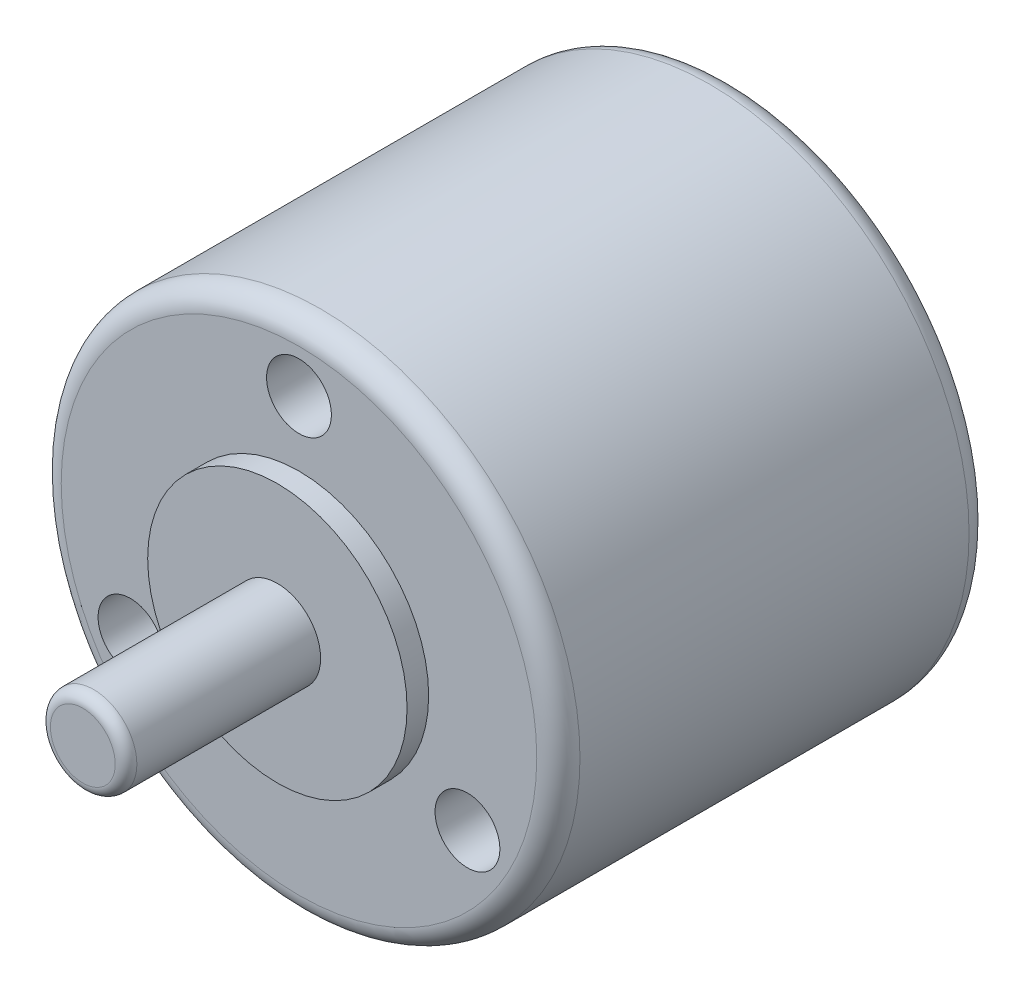
ISO-10303-21;
HEADER;
FILE_DESCRIPTION(('STEP AP214'),'2;1');
FILE_NAME('part.step','',(''),(''),'','','');
FILE_SCHEMA(('AUTOMOTIVE_DESIGN { 1 0 10303 214 1 1 1 1 }'));
ENDSEC;
DATA;
#1=APPLICATION_CONTEXT('core data for automotive mechanical design processes');
#2=APPLICATION_PROTOCOL_DEFINITION('international standard','automotive_design',2000,#1);
#3=PRODUCT_CONTEXT('',#1,'mechanical');
#4=PRODUCT('Part','Part','',(#3));
#5=PRODUCT_RELATED_PRODUCT_CATEGORY('part','',(#4));
#6=PRODUCT_DEFINITION_FORMATION('','',#4);
#7=PRODUCT_DEFINITION_CONTEXT('part definition',#1,'design');
#8=PRODUCT_DEFINITION('design','',#6,#7);
#9=PRODUCT_DEFINITION_SHAPE('','',#8);
#10=(LENGTH_UNIT() NAMED_UNIT(*) SI_UNIT(.MILLI.,.METRE.));
#11=(NAMED_UNIT(*) PLANE_ANGLE_UNIT() SI_UNIT($,.RADIAN.));
#12=(NAMED_UNIT(*) SI_UNIT($,.STERADIAN.) SOLID_ANGLE_UNIT());
#13=UNCERTAINTY_MEASURE_WITH_UNIT(LENGTH_MEASURE(1.E-05),#10,'distance_accuracy_value','');
#14=(GEOMETRIC_REPRESENTATION_CONTEXT(3) GLOBAL_UNCERTAINTY_ASSIGNED_CONTEXT((#13)) GLOBAL_UNIT_ASSIGNED_CONTEXT((#10,
#11,#12)) REPRESENTATION_CONTEXT('',''));
#15=CARTESIAN_POINT('',(0.,0.,0.));
#16=DIRECTION('',(0.,0.,1.));
#17=DIRECTION('',(1.,0.,0.));
#18=AXIS2_PLACEMENT_3D('',#15,#16,#17);
#19=CARTESIAN_POINT('',(0.,0.,0.));
#20=DIRECTION('',(0.,0.,1.));
#21=DIRECTION('',(1.,0.,0.));
#22=AXIS2_PLACEMENT_3D('',#19,#20,#21);
#23=PLANE('',#22);
#24=CARTESIAN_POINT('',(7.79422863405994,-4.50000000000002,0.));
#25=DIRECTION('',(0.,0.,1.));
#26=DIRECTION('',(1.,0.,0.));
#27=AXIS2_PLACEMENT_3D('',#24,#25,#26);
#28=CIRCLE('',#27,1.5);
#29=CARTESIAN_POINT('',(9.29422863405994,-4.50000000000002,0.));
#30=VERTEX_POINT('',#29);
#31=EDGE_CURVE('E77',#30,#30,#28,.T.);
#32=ORIENTED_EDGE('',*,*,#31,.F.);
#33=EDGE_LOOP('',(#32));
#34=FACE_BOUND('',#33,.T.);
#35=CARTESIAN_POINT('',(-7.79422863405994,-4.50000000000001,0.));
#36=DIRECTION('',(0.,0.,1.));
#37=DIRECTION('',(1.,0.,0.));
#38=AXIS2_PLACEMENT_3D('',#35,#36,#37);
#39=CIRCLE('',#38,1.5);
#40=CARTESIAN_POINT('',(-6.29422863405994,-4.50000000000001,0.));
#41=VERTEX_POINT('',#40);
#42=EDGE_CURVE('E71',#41,#41,#39,.T.);
#43=ORIENTED_EDGE('',*,*,#42,.F.);
#44=EDGE_LOOP('',(#43));
#45=FACE_BOUND('',#44,.T.);
#46=CARTESIAN_POINT('',(0.,9.,0.));
#47=DIRECTION('',(0.,0.,1.));
#48=DIRECTION('',(1.,0.,0.));
#49=AXIS2_PLACEMENT_3D('',#46,#47,#48);
#50=CIRCLE('',#49,1.5);
#51=CARTESIAN_POINT('',(1.5,9.,0.));
#52=VERTEX_POINT('',#51);
#53=EDGE_CURVE('E65',#52,#52,#50,.T.);
#54=ORIENTED_EDGE('',*,*,#53,.F.);
#55=EDGE_LOOP('',(#54));
#56=FACE_BOUND('',#55,.T.);
#57=CARTESIAN_POINT('',(0.,0.,0.));
#58=DIRECTION('',(0.,0.,1.));
#59=DIRECTION('',(1.,0.,0.));
#60=AXIS2_PLACEMENT_3D('',#57,#58,#59);
#61=CIRCLE('',#60,11.);
#62=CARTESIAN_POINT('',(11.,0.,0.));
#63=VERTEX_POINT('',#62);
#64=EDGE_CURVE('E55',#63,#63,#61,.T.);
#65=ORIENTED_EDGE('',*,*,#64,.T.);
#66=EDGE_LOOP('',(#65));
#67=FACE_BOUND('',#66,.T.);
#68=CARTESIAN_POINT('',(0.,0.,0.));
#69=DIRECTION('',(0.,0.,1.));
#70=DIRECTION('',(1.,0.,0.));
#71=AXIS2_PLACEMENT_3D('',#68,#69,#70);
#72=CIRCLE('',#71,6.);
#73=CARTESIAN_POINT('',(6.,0.,0.));
#74=VERTEX_POINT('',#73);
#75=EDGE_CURVE('E58',#74,#74,#72,.T.);
#76=ORIENTED_EDGE('',*,*,#75,.F.);
#77=EDGE_LOOP('',(#76));
#78=FACE_BOUND('',#77,.T.);
#79=ADVANCED_FACE('F32',(#34,#45,#56,#67,#78),#23,.T.);
#80=CARTESIAN_POINT('',(0.,0.,-20.));
#81=DIRECTION('',(0.,0.,1.));
#82=DIRECTION('',(1.,0.,0.));
#83=AXIS2_PLACEMENT_3D('',#80,#81,#82);
#84=CYLINDRICAL_SURFACE('',#83,12.);
#85=CARTESIAN_POINT('',(0.,0.,-19.));
#86=DIRECTION('',(0.,0.,1.));
#87=DIRECTION('',(1.,0.,0.));
#88=AXIS2_PLACEMENT_3D('',#85,#86,#87);
#89=CIRCLE('',#88,12.);
#90=CARTESIAN_POINT('',(12.,0.,-19.));
#91=VERTEX_POINT('',#90);
#92=EDGE_CURVE('E49',#91,#91,#89,.T.);
#93=ORIENTED_EDGE('',*,*,#92,.T.);
#94=EDGE_LOOP('',(#93));
#95=FACE_BOUND('',#94,.T.);
#96=CARTESIAN_POINT('',(0.,0.,-1.));
#97=DIRECTION('',(0.,0.,1.));
#98=DIRECTION('',(1.,0.,0.));
#99=AXIS2_PLACEMENT_3D('',#96,#97,#98);
#100=CIRCLE('',#99,12.);
#101=CARTESIAN_POINT('',(12.,0.,-1.));
#102=VERTEX_POINT('',#101);
#103=EDGE_CURVE('E52',#102,#102,#100,.F.);
#104=ORIENTED_EDGE('',*,*,#103,.T.);
#105=EDGE_LOOP('',(#104));
#106=FACE_BOUND('',#105,.T.);
#107=ADVANCED_FACE('F94',(#95,#106),#84,.T.);
#108=CARTESIAN_POINT('',(0.,0.,-20.));
#109=DIRECTION('',(0.,0.,1.));
#110=DIRECTION('',(1.,0.,0.));
#111=AXIS2_PLACEMENT_3D('',#108,#109,#110);
#112=PLANE('',#111);
#113=CARTESIAN_POINT('',(0.,0.,-20.));
#114=DIRECTION('',(0.,0.,1.));
#115=DIRECTION('',(1.,0.,0.));
#116=AXIS2_PLACEMENT_3D('',#113,#114,#115);
#117=CIRCLE('',#116,11.);
#118=CARTESIAN_POINT('',(11.,0.,-20.));
#119=VERTEX_POINT('',#118);
#120=EDGE_CURVE('E44',#119,#119,#117,.F.);
#121=ORIENTED_EDGE('',*,*,#120,.T.);
#122=EDGE_LOOP('',(#121));
#123=FACE_BOUND('',#122,.T.);
#124=ADVANCED_FACE('F127',(#123),#112,.F.);
#125=CARTESIAN_POINT('',(0.,0.,-1.));
#126=DIRECTION('',(0.,0.,1.));
#127=DIRECTION('',(1.,0.,0.));
#128=AXIS2_PLACEMENT_3D('',#125,#126,#127);
#129=TOROIDAL_SURFACE('',#128,11.,1.);
#130=ORIENTED_EDGE('',*,*,#103,.F.);
#131=EDGE_LOOP('',(#130));
#132=FACE_BOUND('',#131,.T.);
#133=ORIENTED_EDGE('',*,*,#64,.F.);
#134=EDGE_LOOP('',(#133));
#135=FACE_BOUND('',#134,.T.);
#136=ADVANCED_FACE('F129',(#132,#135),#129,.T.);
#137=CARTESIAN_POINT('',(0.,0.,-19.));
#138=DIRECTION('',(0.,0.,1.));
#139=DIRECTION('',(1.,0.,0.));
#140=AXIS2_PLACEMENT_3D('',#137,#138,#139);
#141=TOROIDAL_SURFACE('',#140,11.,1.);
#142=ORIENTED_EDGE('',*,*,#120,.F.);
#143=EDGE_LOOP('',(#142));
#144=FACE_BOUND('',#143,.T.);
#145=ORIENTED_EDGE('',*,*,#92,.F.);
#146=EDGE_LOOP('',(#145));
#147=FACE_BOUND('',#146,.T.);
#148=ADVANCED_FACE('F116',(#144,#147),#141,.T.);
#149=CARTESIAN_POINT('',(0.,0.,1.));
#150=DIRECTION('',(0.,0.,1.));
#151=DIRECTION('',(1.,0.,0.));
#152=AXIS2_PLACEMENT_3D('',#149,#150,#151);
#153=PLANE('',#152);
#154=CARTESIAN_POINT('',(0.,0.,1.));
#155=DIRECTION('',(0.,0.,1.));
#156=DIRECTION('',(1.,0.,0.));
#157=AXIS2_PLACEMENT_3D('',#154,#155,#156);
#158=CIRCLE('',#157,6.);
#159=CARTESIAN_POINT('',(6.,0.,1.));
#160=VERTEX_POINT('',#159);
#161=EDGE_CURVE('E61',#160,#160,#158,.T.);
#162=ORIENTED_EDGE('',*,*,#161,.T.);
#163=EDGE_LOOP('',(#162));
#164=FACE_BOUND('',#163,.T.);
#165=CARTESIAN_POINT('',(0.,0.,0.999999999999999));
#166=DIRECTION('',(0.,0.,1.));
#167=DIRECTION('',(1.,0.,0.));
#168=AXIS2_PLACEMENT_3D('',#165,#166,#167);
#169=CIRCLE('',#168,2.);
#170=CARTESIAN_POINT('',(2.,0.,0.999999999999999));
#171=VERTEX_POINT('',#170);
#172=EDGE_CURVE('E36',#171,#171,#169,.T.);
#173=ORIENTED_EDGE('',*,*,#172,.F.);
#174=EDGE_LOOP('',(#173));
#175=FACE_BOUND('',#174,.T.);
#176=ADVANCED_FACE('F107',(#164,#175),#153,.T.);
#177=CARTESIAN_POINT('',(0.,0.,1.));
#178=DIRECTION('',(0.,0.,-1.));
#179=DIRECTION('',(-1.,0.,0.));
#180=AXIS2_PLACEMENT_3D('',#177,#178,#179);
#181=CYLINDRICAL_SURFACE('',#180,6.);
#182=ORIENTED_EDGE('',*,*,#161,.F.);
#183=EDGE_LOOP('',(#182));
#184=FACE_BOUND('',#183,.T.);
#185=ORIENTED_EDGE('',*,*,#75,.T.);
#186=EDGE_LOOP('',(#185));
#187=FACE_BOUND('',#186,.T.);
#188=ADVANCED_FACE('F104',(#184,#187),#181,.T.);
#189=CARTESIAN_POINT('',(0.,0.,10.));
#190=DIRECTION('',(0.,0.,1.));
#191=DIRECTION('',(1.,0.,0.));
#192=AXIS2_PLACEMENT_3D('',#189,#190,#191);
#193=PLANE('',#192);
#194=CARTESIAN_POINT('',(0.,0.,10.));
#195=DIRECTION('',(0.,0.,1.));
#196=DIRECTION('',(1.,0.,0.));
#197=AXIS2_PLACEMENT_3D('',#194,#195,#196);
#198=CIRCLE('',#197,1.5);
#199=CARTESIAN_POINT('',(1.5,0.,10.));
#200=VERTEX_POINT('',#199);
#201=EDGE_CURVE('E40',#200,#200,#198,.T.);
#202=ORIENTED_EDGE('',*,*,#201,.T.);
#203=EDGE_LOOP('',(#202));
#204=FACE_BOUND('',#203,.T.);
#205=ADVANCED_FACE('F106',(#204),#193,.T.);
#206=CARTESIAN_POINT('',(0.,0.,9.5));
#207=DIRECTION('',(0.,0.,1.));
#208=DIRECTION('',(1.,0.,0.));
#209=AXIS2_PLACEMENT_3D('',#206,#207,#208);
#210=TOROIDAL_SURFACE('',#209,1.5,0.5);
#211=CARTESIAN_POINT('',(0.,0.,9.5));
#212=DIRECTION('',(0.,0.,1.));
#213=DIRECTION('',(1.,0.,0.));
#214=AXIS2_PLACEMENT_3D('',#211,#212,#213);
#215=CIRCLE('',#214,2.);
#216=CARTESIAN_POINT('',(2.,0.,9.5));
#217=VERTEX_POINT('',#216);
#218=EDGE_CURVE('E10',#217,#217,#215,.F.);
#219=ORIENTED_EDGE('',*,*,#218,.F.);
#220=EDGE_LOOP('',(#219));
#221=FACE_BOUND('',#220,.T.);
#222=ORIENTED_EDGE('',*,*,#201,.F.);
#223=EDGE_LOOP('',(#222));
#224=FACE_BOUND('',#223,.T.);
#225=ADVANCED_FACE('F34',(#221,#224),#210,.T.);
#226=CARTESIAN_POINT('',(0.,0.,10.));
#227=DIRECTION('',(0.,0.,-1.));
#228=DIRECTION('',(-1.,0.,0.));
#229=AXIS2_PLACEMENT_3D('',#226,#227,#228);
#230=CYLINDRICAL_SURFACE('',#229,2.);
#231=ORIENTED_EDGE('',*,*,#172,.T.);
#232=EDGE_LOOP('',(#231));
#233=FACE_BOUND('',#232,.T.);
#234=ORIENTED_EDGE('',*,*,#218,.T.);
#235=EDGE_LOOP('',(#234));
#236=FACE_BOUND('',#235,.T.);
#237=ADVANCED_FACE('F122',(#233,#236),#230,.T.);
#238=CARTESIAN_POINT('',(0.,9.,-5.));
#239=DIRECTION('',(0.,0.,1.));
#240=DIRECTION('',(1.,0.,0.));
#241=AXIS2_PLACEMENT_3D('',#238,#239,#240);
#242=CYLINDRICAL_SURFACE('',#241,1.5);
#243=CARTESIAN_POINT('',(0.,9.,-5.));
#244=DIRECTION('',(0.,0.,1.));
#245=DIRECTION('',(1.,0.,0.));
#246=AXIS2_PLACEMENT_3D('',#243,#244,#245);
#247=CIRCLE('',#246,1.5);
#248=CARTESIAN_POINT('',(1.5,9.,-5.));
#249=VERTEX_POINT('',#248);
#250=EDGE_CURVE('E62',#249,#249,#247,.T.);
#251=ORIENTED_EDGE('',*,*,#250,.F.);
#252=EDGE_LOOP('',(#251));
#253=FACE_BOUND('',#252,.T.);
#254=ORIENTED_EDGE('',*,*,#53,.T.);
#255=EDGE_LOOP('',(#254));
#256=FACE_BOUND('',#255,.T.);
#257=ADVANCED_FACE('F125',(#253,#256),#242,.F.);
#258=CARTESIAN_POINT('',(0.,9.,-5.));
#259=DIRECTION('',(0.,0.,1.));
#260=DIRECTION('',(1.,0.,0.));
#261=AXIS2_PLACEMENT_3D('',#258,#259,#260);
#262=PLANE('',#261);
#263=ORIENTED_EDGE('',*,*,#250,.T.);
#264=EDGE_LOOP('',(#263));
#265=FACE_BOUND('',#264,.T.);
#266=ADVANCED_FACE('F186',(#265),#262,.T.);
#267=CARTESIAN_POINT('',(-7.79422863405994,-4.50000000000001,-5.));
#268=DIRECTION('',(0.,0.,1.));
#269=DIRECTION('',(1.,0.,0.));
#270=AXIS2_PLACEMENT_3D('',#267,#268,#269);
#271=CYLINDRICAL_SURFACE('',#270,1.5);
#272=CARTESIAN_POINT('',(-7.79422863405994,-4.50000000000001,-5.));
#273=DIRECTION('',(0.,0.,1.));
#274=DIRECTION('',(1.,0.,0.));
#275=AXIS2_PLACEMENT_3D('',#272,#273,#274);
#276=CIRCLE('',#275,1.5);
#277=CARTESIAN_POINT('',(-6.29422863405994,-4.50000000000001,-5.));
#278=VERTEX_POINT('',#277);
#279=EDGE_CURVE('E68',#278,#278,#276,.T.);
#280=ORIENTED_EDGE('',*,*,#279,.F.);
#281=EDGE_LOOP('',(#280));
#282=FACE_BOUND('',#281,.T.);
#283=ORIENTED_EDGE('',*,*,#42,.T.);
#284=EDGE_LOOP('',(#283));
#285=FACE_BOUND('',#284,.T.);
#286=ADVANCED_FACE('F195',(#282,#285),#271,.F.);
#287=CARTESIAN_POINT('',(-7.79422863405994,-4.50000000000001,-5.));
#288=DIRECTION('',(0.,0.,1.));
#289=DIRECTION('',(1.,0.,0.));
#290=AXIS2_PLACEMENT_3D('',#287,#288,#289);
#291=PLANE('',#290);
#292=ORIENTED_EDGE('',*,*,#279,.T.);
#293=EDGE_LOOP('',(#292));
#294=FACE_BOUND('',#293,.T.);
#295=ADVANCED_FACE('F88',(#294),#291,.T.);
#296=CARTESIAN_POINT('',(7.79422863405994,-4.50000000000002,-5.));
#297=DIRECTION('',(0.,0.,1.));
#298=DIRECTION('',(1.,0.,0.));
#299=AXIS2_PLACEMENT_3D('',#296,#297,#298);
#300=CYLINDRICAL_SURFACE('',#299,1.5);
#301=CARTESIAN_POINT('',(7.79422863405994,-4.50000000000002,-5.));
#302=DIRECTION('',(0.,0.,1.));
#303=DIRECTION('',(1.,0.,0.));
#304=AXIS2_PLACEMENT_3D('',#301,#302,#303);
#305=CIRCLE('',#304,1.5);
#306=CARTESIAN_POINT('',(9.29422863405994,-4.50000000000002,-5.));
#307=VERTEX_POINT('',#306);
#308=EDGE_CURVE('E74',#307,#307,#305,.T.);
#309=ORIENTED_EDGE('',*,*,#308,.F.);
#310=EDGE_LOOP('',(#309));
#311=FACE_BOUND('',#310,.T.);
#312=ORIENTED_EDGE('',*,*,#31,.T.);
#313=EDGE_LOOP('',(#312));
#314=FACE_BOUND('',#313,.T.);
#315=ADVANCED_FACE('F85',(#311,#314),#300,.F.);
#316=CARTESIAN_POINT('',(7.79422863405994,-4.50000000000002,-5.));
#317=DIRECTION('',(0.,0.,1.));
#318=DIRECTION('',(1.,0.,0.));
#319=AXIS2_PLACEMENT_3D('',#316,#317,#318);
#320=PLANE('',#319);
#321=ORIENTED_EDGE('',*,*,#308,.T.);
#322=EDGE_LOOP('',(#321));
#323=FACE_BOUND('',#322,.T.);
#324=ADVANCED_FACE('F83',(#323),#320,.T.);
#325=CLOSED_SHELL('',(#79,#107,#124,#136,#148,#176,#188,#205,#225,#237,#257,#266,#286,#295,#315,#324));
#326=MANIFOLD_SOLID_BREP('B2',#325);
#327=ADVANCED_BREP_SHAPE_REPRESENTATION('',(#18,#326),#14);
#328=SHAPE_DEFINITION_REPRESENTATION(#9,#327);
ENDSEC;
END-ISO-10303-21;
